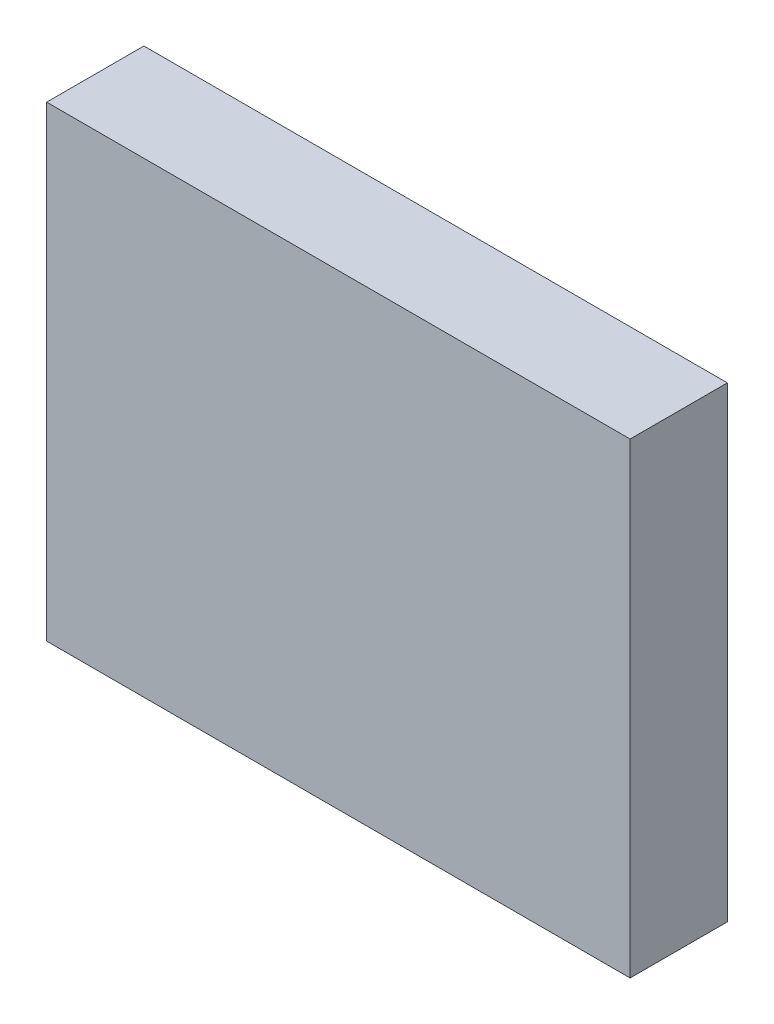
ISO-10303-21;
HEADER;
FILE_DESCRIPTION(('STEP AP214'),'2;1');
FILE_NAME('part.step','',(''),(''),'','','');
FILE_SCHEMA(('AUTOMOTIVE_DESIGN { 1 0 10303 214 1 1 1 1 }'));
ENDSEC;
DATA;
#1=APPLICATION_CONTEXT('core data for automotive mechanical design processes');
#2=APPLICATION_PROTOCOL_DEFINITION('international standard','automotive_design',2000,#1);
#3=PRODUCT_CONTEXT('',#1,'mechanical');
#4=PRODUCT('Part','Part','',(#3));
#5=PRODUCT_RELATED_PRODUCT_CATEGORY('part','',(#4));
#6=PRODUCT_DEFINITION_FORMATION('','',#4);
#7=PRODUCT_DEFINITION_CONTEXT('part definition',#1,'design');
#8=PRODUCT_DEFINITION('design','',#6,#7);
#9=PRODUCT_DEFINITION_SHAPE('','',#8);
#10=(LENGTH_UNIT() NAMED_UNIT(*) SI_UNIT(.MILLI.,.METRE.));
#11=(NAMED_UNIT(*) PLANE_ANGLE_UNIT() SI_UNIT($,.RADIAN.));
#12=(NAMED_UNIT(*) SI_UNIT($,.STERADIAN.) SOLID_ANGLE_UNIT());
#13=UNCERTAINTY_MEASURE_WITH_UNIT(LENGTH_MEASURE(1.E-05),#10,'distance_accuracy_value','');
#14=(GEOMETRIC_REPRESENTATION_CONTEXT(3) GLOBAL_UNCERTAINTY_ASSIGNED_CONTEXT((#13)) GLOBAL_UNIT_ASSIGNED_CONTEXT((#10,
#11,#12)) REPRESENTATION_CONTEXT('',''));
#15=CARTESIAN_POINT('',(0.,0.,0.));
#16=DIRECTION('',(0.,0.,1.));
#17=DIRECTION('',(1.,0.,0.));
#18=AXIS2_PLACEMENT_3D('',#15,#16,#17);
#19=CARTESIAN_POINT('',(-9.16050580360928,13.2148648648649,5.));
#20=DIRECTION('',(1.,0.,0.));
#21=DIRECTION('',(0.,1.,0.));
#22=AXIS2_PLACEMENT_3D('',#19,#20,#21);
#23=PLANE('',#22);
#24=DIRECTION('',(0.,-1.,0.));
#25=VECTOR('',#24,1.);
#26=CARTESIAN_POINT('',(-9.16050580360928,13.2148648648649,0.));
#27=LINE('',#26,#25);
#28=CARTESIAN_POINT('',(-9.16050580360928,13.2148648648649,0.));
#29=VERTEX_POINT('',#28);
#30=CARTESIAN_POINT('',(-9.16050580360927,-10.7851351351351,0.));
#31=VERTEX_POINT('',#30);
#32=EDGE_CURVE('E94',#29,#31,#27,.T.);
#33=ORIENTED_EDGE('',*,*,#32,.T.);
#34=DIRECTION('',(0.,0.,-1.));
#35=VECTOR('',#34,1.);
#36=CARTESIAN_POINT('',(-9.16050580360927,-10.7851351351351,5.));
#37=LINE('',#36,#35);
#38=CARTESIAN_POINT('',(-9.16050580360927,-10.7851351351351,5.));
#39=VERTEX_POINT('',#38);
#40=EDGE_CURVE('E11',#39,#31,#37,.T.);
#41=ORIENTED_EDGE('',*,*,#40,.F.);
#42=DIRECTION('',(0.,-1.,0.));
#43=VECTOR('',#42,1.);
#44=CARTESIAN_POINT('',(-9.16050580360928,13.2148648648649,5.));
#45=LINE('',#44,#43);
#46=CARTESIAN_POINT('',(-9.16050580360928,13.2148648648649,5.));
#47=VERTEX_POINT('',#46);
#48=EDGE_CURVE('E82',#47,#39,#45,.T.);
#49=ORIENTED_EDGE('',*,*,#48,.F.);
#50=DIRECTION('',(0.,0.,-1.));
#51=VECTOR('',#50,1.);
#52=CARTESIAN_POINT('',(-9.16050580360928,13.2148648648649,5.));
#53=LINE('',#52,#51);
#54=EDGE_CURVE('E90',#47,#29,#53,.T.);
#55=ORIENTED_EDGE('',*,*,#54,.T.);
#56=EDGE_LOOP('',(#33,#41,#49,#55));
#57=FACE_BOUND('',#56,.T.);
#58=ADVANCED_FACE('F31',(#57),#23,.F.);
#59=CARTESIAN_POINT('',(-9.16050580360927,-10.7851351351351,5.));
#60=DIRECTION('',(0.,1.,0.));
#61=DIRECTION('',(0.,0.,1.));
#62=AXIS2_PLACEMENT_3D('',#59,#60,#61);
#63=PLANE('',#62);
#64=DIRECTION('',(1.,0.,0.));
#65=VECTOR('',#64,1.);
#66=CARTESIAN_POINT('',(-9.16050580360927,-10.7851351351351,0.));
#67=LINE('',#66,#65);
#68=CARTESIAN_POINT('',(20.8394941963907,-10.7851351351351,0.));
#69=VERTEX_POINT('',#68);
#70=EDGE_CURVE('E86',#31,#69,#67,.T.);
#71=ORIENTED_EDGE('',*,*,#70,.T.);
#72=DIRECTION('',(0.,0.,-1.));
#73=VECTOR('',#72,1.);
#74=CARTESIAN_POINT('',(20.8394941963907,-10.7851351351351,5.));
#75=LINE('',#74,#73);
#76=CARTESIAN_POINT('',(20.8394941963907,-10.7851351351351,5.));
#77=VERTEX_POINT('',#76);
#78=EDGE_CURVE('E39',#77,#69,#75,.T.);
#79=ORIENTED_EDGE('',*,*,#78,.F.);
#80=DIRECTION('',(1.,0.,0.));
#81=VECTOR('',#80,1.);
#82=CARTESIAN_POINT('',(-9.16050580360927,-10.7851351351351,5.));
#83=LINE('',#82,#81);
#84=EDGE_CURVE('E77',#39,#77,#83,.T.);
#85=ORIENTED_EDGE('',*,*,#84,.F.);
#86=ORIENTED_EDGE('',*,*,#40,.T.);
#87=EDGE_LOOP('',(#71,#79,#85,#86));
#88=FACE_BOUND('',#87,.T.);
#89=ADVANCED_FACE('F85',(#88),#63,.F.);
#90=CARTESIAN_POINT('',(20.8394941963907,13.2148648648649,5.));
#91=DIRECTION('',(-1.,0.,0.));
#92=DIRECTION('',(0.,-1.,0.));
#93=AXIS2_PLACEMENT_3D('',#90,#91,#92);
#94=PLANE('',#93);
#95=DIRECTION('',(0.,1.,0.));
#96=VECTOR('',#95,1.);
#97=CARTESIAN_POINT('',(20.8394941963907,13.2148648648649,0.));
#98=LINE('',#97,#96);
#99=CARTESIAN_POINT('',(20.8394941963907,13.2148648648649,0.));
#100=VERTEX_POINT('',#99);
#101=EDGE_CURVE('E64',#69,#100,#98,.T.);
#102=ORIENTED_EDGE('',*,*,#101,.T.);
#103=DIRECTION('',(0.,0.,-1.));
#104=VECTOR('',#103,1.);
#105=CARTESIAN_POINT('',(20.8394941963907,13.2148648648649,5.));
#106=LINE('',#105,#104);
#107=CARTESIAN_POINT('',(20.8394941963907,13.2148648648649,5.));
#108=VERTEX_POINT('',#107);
#109=EDGE_CURVE('E87',#108,#100,#106,.T.);
#110=ORIENTED_EDGE('',*,*,#109,.F.);
#111=DIRECTION('',(0.,1.,0.));
#112=VECTOR('',#111,1.);
#113=CARTESIAN_POINT('',(20.8394941963907,13.2148648648649,5.));
#114=LINE('',#113,#112);
#115=EDGE_CURVE('E80',#77,#108,#114,.T.);
#116=ORIENTED_EDGE('',*,*,#115,.F.);
#117=ORIENTED_EDGE('',*,*,#78,.T.);
#118=EDGE_LOOP('',(#102,#110,#116,#117));
#119=FACE_BOUND('',#118,.T.);
#120=ADVANCED_FACE('F88',(#119),#94,.F.);
#121=CARTESIAN_POINT('',(-9.16050580360928,13.2148648648649,5.));
#122=DIRECTION('',(0.,-1.,0.));
#123=DIRECTION('',(0.,0.,-1.));
#124=AXIS2_PLACEMENT_3D('',#121,#122,#123);
#125=PLANE('',#124);
#126=DIRECTION('',(-1.,0.,0.));
#127=VECTOR('',#126,1.);
#128=CARTESIAN_POINT('',(-9.16050580360928,13.2148648648649,0.));
#129=LINE('',#128,#127);
#130=EDGE_CURVE('E70',#100,#29,#129,.T.);
#131=ORIENTED_EDGE('',*,*,#130,.T.);
#132=ORIENTED_EDGE('',*,*,#54,.F.);
#133=DIRECTION('',(-1.,0.,0.));
#134=VECTOR('',#133,1.);
#135=CARTESIAN_POINT('',(-9.16050580360928,13.2148648648649,5.));
#136=LINE('',#135,#134);
#137=EDGE_CURVE('E47',#108,#47,#136,.T.);
#138=ORIENTED_EDGE('',*,*,#137,.F.);
#139=ORIENTED_EDGE('',*,*,#109,.T.);
#140=EDGE_LOOP('',(#131,#132,#138,#139));
#141=FACE_BOUND('',#140,.T.);
#142=ADVANCED_FACE('F101',(#141),#125,.F.);
#143=CARTESIAN_POINT('',(-9.16050580360927,-10.7851351351351,5.));
#144=DIRECTION('',(0.,0.,1.));
#145=DIRECTION('',(1.,0.,0.));
#146=AXIS2_PLACEMENT_3D('',#143,#144,#145);
#147=PLANE('',#146);
#148=ORIENTED_EDGE('',*,*,#48,.T.);
#149=ORIENTED_EDGE('',*,*,#84,.T.);
#150=ORIENTED_EDGE('',*,*,#115,.T.);
#151=ORIENTED_EDGE('',*,*,#137,.T.);
#152=EDGE_LOOP('',(#148,#149,#150,#151));
#153=FACE_BOUND('',#152,.T.);
#154=ADVANCED_FACE('F78',(#153),#147,.T.);
#155=CARTESIAN_POINT('',(-9.16050580360927,-10.7851351351351,0.));
#156=DIRECTION('',(0.,0.,1.));
#157=DIRECTION('',(1.,0.,0.));
#158=AXIS2_PLACEMENT_3D('',#155,#156,#157);
#159=PLANE('',#158);
#160=ORIENTED_EDGE('',*,*,#32,.F.);
#161=ORIENTED_EDGE('',*,*,#130,.F.);
#162=ORIENTED_EDGE('',*,*,#101,.F.);
#163=ORIENTED_EDGE('',*,*,#70,.F.);
#164=EDGE_LOOP('',(#160,#161,#162,#163));
#165=FACE_BOUND('',#164,.T.);
#166=ADVANCED_FACE('F104',(#165),#159,.F.);
#167=CLOSED_SHELL('',(#58,#89,#120,#142,#154,#166));
#168=MANIFOLD_SOLID_BREP('B2',#167);
#169=ADVANCED_BREP_SHAPE_REPRESENTATION('',(#18,#168),#14);
#170=SHAPE_DEFINITION_REPRESENTATION(#9,#169);
ENDSEC;
END-ISO-10303-21;
